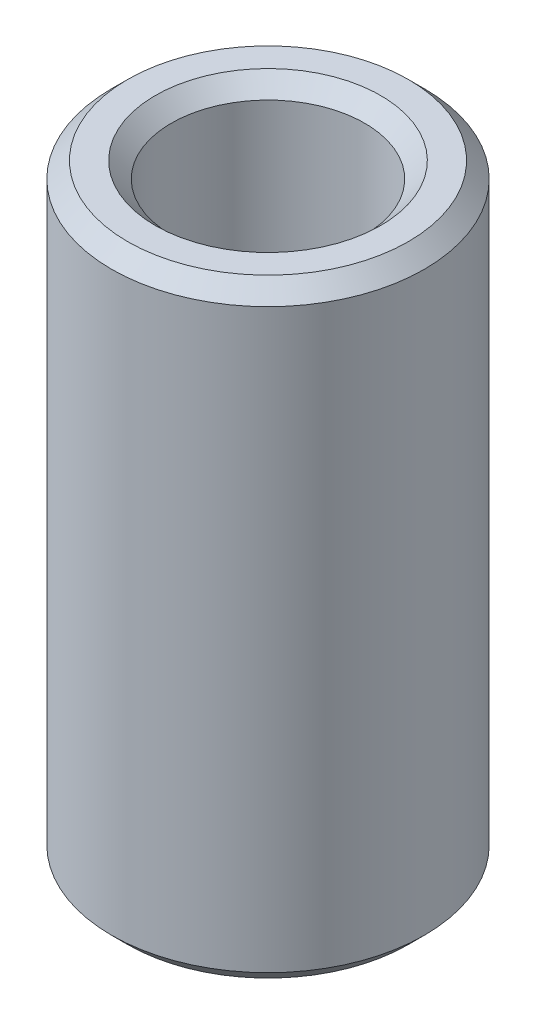
ISO-10303-21;
HEADER;
FILE_DESCRIPTION(('STEP AP214'),'2;1');
FILE_NAME('part.step','',(''),(''),'','','');
FILE_SCHEMA(('AUTOMOTIVE_DESIGN { 1 0 10303 214 1 1 1 1 }'));
ENDSEC;
DATA;
#1=APPLICATION_CONTEXT('core data for automotive mechanical design processes');
#2=APPLICATION_PROTOCOL_DEFINITION('international standard','automotive_design',2000,#1);
#3=PRODUCT_CONTEXT('',#1,'mechanical');
#4=PRODUCT('Part','Part','',(#3));
#5=PRODUCT_RELATED_PRODUCT_CATEGORY('part','',(#4));
#6=PRODUCT_DEFINITION_FORMATION('','',#4);
#7=PRODUCT_DEFINITION_CONTEXT('part definition',#1,'design');
#8=PRODUCT_DEFINITION('design','',#6,#7);
#9=PRODUCT_DEFINITION_SHAPE('','',#8);
#10=(LENGTH_UNIT() NAMED_UNIT(*) SI_UNIT(.MILLI.,.METRE.));
#11=(NAMED_UNIT(*) PLANE_ANGLE_UNIT() SI_UNIT($,.RADIAN.));
#12=(NAMED_UNIT(*) SI_UNIT($,.STERADIAN.) SOLID_ANGLE_UNIT());
#13=UNCERTAINTY_MEASURE_WITH_UNIT(LENGTH_MEASURE(1.E-05),#10,'distance_accuracy_value','');
#14=(GEOMETRIC_REPRESENTATION_CONTEXT(3) GLOBAL_UNCERTAINTY_ASSIGNED_CONTEXT((#13)) GLOBAL_UNIT_ASSIGNED_CONTEXT((#10,
#11,#12)) REPRESENTATION_CONTEXT('',''));
#15=CARTESIAN_POINT('',(0.,0.,0.));
#16=DIRECTION('',(0.,0.,1.));
#17=DIRECTION('',(1.,0.,0.));
#18=AXIS2_PLACEMENT_3D('',#15,#16,#17);
#19=CARTESIAN_POINT('',(0.,145.956649865755,0.));
#20=DIRECTION('',(0.,-1.,0.));
#21=DIRECTION('',(0.,0.,-1.));
#22=AXIS2_PLACEMENT_3D('',#19,#20,#21);
#23=CYLINDRICAL_SURFACE('',#22,37.5);
#24=CARTESIAN_POINT('',(0.,3.83153653893431,0.));
#25=DIRECTION('',(0.,1.,0.));
#26=DIRECTION('',(0.,0.,1.));
#27=AXIS2_PLACEMENT_3D('',#24,#25,#26);
#28=CIRCLE('',#27,37.5);
#29=CARTESIAN_POINT('',(0.,3.83153653893431,37.5));
#30=VERTEX_POINT('',#29);
#31=EDGE_CURVE('E10',#30,#30,#28,.T.);
#32=ORIENTED_EDGE('',*,*,#31,.T.);
#33=EDGE_LOOP('',(#32));
#34=FACE_BOUND('',#33,.T.);
#35=CARTESIAN_POINT('',(0.,142.125113326821,0.));
#36=DIRECTION('',(0.,1.,0.));
#37=DIRECTION('',(0.,0.,1.));
#38=AXIS2_PLACEMENT_3D('',#35,#36,#37);
#39=CIRCLE('',#38,37.5);
#40=CARTESIAN_POINT('',(0.,142.125113326821,37.5));
#41=VERTEX_POINT('',#40);
#42=EDGE_CURVE('E50',#41,#41,#39,.F.);
#43=ORIENTED_EDGE('',*,*,#42,.T.);
#44=EDGE_LOOP('',(#43));
#45=FACE_BOUND('',#44,.T.);
#46=ADVANCED_FACE('F39',(#34,#45),#23,.T.);
#47=CARTESIAN_POINT('',(0.,145.956649865755,0.));
#48=DIRECTION('',(0.,1.,0.));
#49=DIRECTION('',(0.,0.,1.));
#50=AXIS2_PLACEMENT_3D('',#47,#48,#49);
#51=PLANE('',#50);
#52=CARTESIAN_POINT('',(0.,145.956649865755,0.));
#53=DIRECTION('',(0.,1.,0.));
#54=DIRECTION('',(0.,0.,1.));
#55=AXIS2_PLACEMENT_3D('',#52,#53,#54);
#56=CIRCLE('',#55,27.0184228771106);
#57=CARTESIAN_POINT('',(0.,145.956649865755,27.0184228771106));
#58=VERTEX_POINT('',#57);
#59=EDGE_CURVE('E58',#58,#58,#56,.F.);
#60=ORIENTED_EDGE('',*,*,#59,.T.);
#61=EDGE_LOOP('',(#60));
#62=FACE_BOUND('',#61,.T.);
#63=CARTESIAN_POINT('',(0.,145.956649865755,0.));
#64=DIRECTION('',(0.,1.,0.));
#65=DIRECTION('',(0.,0.,1.));
#66=AXIS2_PLACEMENT_3D('',#63,#64,#65);
#67=CIRCLE('',#66,33.6684634610657);
#68=CARTESIAN_POINT('',(0.,145.956649865755,33.6684634610657));
#69=VERTEX_POINT('',#68);
#70=EDGE_CURVE('E61',#69,#69,#67,.T.);
#71=ORIENTED_EDGE('',*,*,#70,.T.);
#72=EDGE_LOOP('',(#71));
#73=FACE_BOUND('',#72,.T.);
#74=ADVANCED_FACE('F88',(#62,#73),#51,.T.);
#75=CARTESIAN_POINT('',(0.,0.,0.));
#76=DIRECTION('',(0.,1.,0.));
#77=DIRECTION('',(0.,0.,1.));
#78=AXIS2_PLACEMENT_3D('',#75,#76,#77);
#79=PLANE('',#78);
#80=CARTESIAN_POINT('',(0.,0.,0.));
#81=DIRECTION('',(0.,1.,0.));
#82=DIRECTION('',(0.,0.,1.));
#83=AXIS2_PLACEMENT_3D('',#80,#81,#82);
#84=CIRCLE('',#83,27.0184228771106);
#85=CARTESIAN_POINT('',(0.,0.,27.0184228771106));
#86=VERTEX_POINT('',#85);
#87=EDGE_CURVE('E51',#86,#86,#84,.T.);
#88=ORIENTED_EDGE('',*,*,#87,.T.);
#89=EDGE_LOOP('',(#88));
#90=FACE_BOUND('',#89,.T.);
#91=CARTESIAN_POINT('',(0.,0.,0.));
#92=DIRECTION('',(0.,1.,0.));
#93=DIRECTION('',(0.,0.,1.));
#94=AXIS2_PLACEMENT_3D('',#91,#92,#93);
#95=CIRCLE('',#94,33.6684634610657);
#96=CARTESIAN_POINT('',(0.,0.,33.6684634610657));
#97=VERTEX_POINT('',#96);
#98=EDGE_CURVE('E54',#97,#97,#95,.F.);
#99=ORIENTED_EDGE('',*,*,#98,.T.);
#100=EDGE_LOOP('',(#99));
#101=FACE_BOUND('',#100,.T.);
#102=ADVANCED_FACE('F83',(#90,#101),#79,.F.);
#103=CARTESIAN_POINT('',(0.,145.956649865755,0.));
#104=DIRECTION('',(0.,-1.,0.));
#105=DIRECTION('',(0.,0.,-1.));
#106=AXIS2_PLACEMENT_3D('',#103,#104,#105);
#107=CYLINDRICAL_SURFACE('',#106,23.1868863381763);
#108=CARTESIAN_POINT('',(0.,142.125113326821,0.));
#109=DIRECTION('',(0.,1.,0.));
#110=DIRECTION('',(0.,0.,1.));
#111=AXIS2_PLACEMENT_3D('',#108,#109,#110);
#112=CIRCLE('',#111,23.1868863381763);
#113=CARTESIAN_POINT('',(0.,142.125113326821,23.1868863381763));
#114=VERTEX_POINT('',#113);
#115=EDGE_CURVE('E67',#114,#114,#112,.T.);
#116=ORIENTED_EDGE('',*,*,#115,.T.);
#117=EDGE_LOOP('',(#116));
#118=FACE_BOUND('',#117,.T.);
#119=CARTESIAN_POINT('',(0.,3.83153653893437,0.));
#120=DIRECTION('',(0.,1.,0.));
#121=DIRECTION('',(0.,0.,1.));
#122=AXIS2_PLACEMENT_3D('',#119,#120,#121);
#123=CIRCLE('',#122,23.1868863381763);
#124=CARTESIAN_POINT('',(0.,3.83153653893437,23.1868863381763));
#125=VERTEX_POINT('',#124);
#126=EDGE_CURVE('E69',#125,#125,#123,.F.);
#127=ORIENTED_EDGE('',*,*,#126,.T.);
#128=EDGE_LOOP('',(#127));
#129=FACE_BOUND('',#128,.T.);
#130=ADVANCED_FACE('F71',(#118,#129),#107,.F.);
#131=CARTESIAN_POINT('',(0.,142.125113326821,0.));
#132=DIRECTION('',(0.,1.,0.));
#133=DIRECTION('',(0.,0.,1.));
#134=AXIS2_PLACEMENT_3D('',#131,#132,#133);
#135=CONICAL_SURFACE('',#134,23.1868863381763,0.785398163397448);
#136=ORIENTED_EDGE('',*,*,#59,.F.);
#137=EDGE_LOOP('',(#136));
#138=FACE_BOUND('',#137,.T.);
#139=ORIENTED_EDGE('',*,*,#115,.F.);
#140=EDGE_LOOP('',(#139));
#141=FACE_BOUND('',#140,.T.);
#142=ADVANCED_FACE('F77',(#138,#141),#135,.F.);
#143=CARTESIAN_POINT('',(0.,0.,0.));
#144=DIRECTION('',(0.,-1.,0.));
#145=DIRECTION('',(0.,0.,-1.));
#146=AXIS2_PLACEMENT_3D('',#143,#144,#145);
#147=CONICAL_SURFACE('',#146,27.0184228771106,0.785398163397444);
#148=ORIENTED_EDGE('',*,*,#126,.F.);
#149=EDGE_LOOP('',(#148));
#150=FACE_BOUND('',#149,.T.);
#151=ORIENTED_EDGE('',*,*,#87,.F.);
#152=EDGE_LOOP('',(#151));
#153=FACE_BOUND('',#152,.T.);
#154=ADVANCED_FACE('F73',(#150,#153),#147,.F.);
#155=CARTESIAN_POINT('',(0.,3.83153653893431,0.));
#156=DIRECTION('',(0.,1.,0.));
#157=DIRECTION('',(0.,0.,1.));
#158=AXIS2_PLACEMENT_3D('',#155,#156,#157);
#159=CONICAL_SURFACE('',#158,37.5,0.78539816339745);
#160=ORIENTED_EDGE('',*,*,#98,.F.);
#161=EDGE_LOOP('',(#160));
#162=FACE_BOUND('',#161,.T.);
#163=ORIENTED_EDGE('',*,*,#31,.F.);
#164=EDGE_LOOP('',(#163));
#165=FACE_BOUND('',#164,.T.);
#166=ADVANCED_FACE('F76',(#162,#165),#159,.T.);
#167=CARTESIAN_POINT('',(0.,145.956649865755,0.));
#168=DIRECTION('',(0.,-1.,0.));
#169=DIRECTION('',(0.,0.,-1.));
#170=AXIS2_PLACEMENT_3D('',#167,#168,#169);
#171=CONICAL_SURFACE('',#170,33.6684634610657,0.785398163397441);
#172=ORIENTED_EDGE('',*,*,#42,.F.);
#173=EDGE_LOOP('',(#172));
#174=FACE_BOUND('',#173,.T.);
#175=ORIENTED_EDGE('',*,*,#70,.F.);
#176=EDGE_LOOP('',(#175));
#177=FACE_BOUND('',#176,.T.);
#178=ADVANCED_FACE('F45',(#174,#177),#171,.T.);
#179=CLOSED_SHELL('',(#46,#74,#102,#130,#142,#154,#166,#178));
#180=MANIFOLD_SOLID_BREP('B2',#179);
#181=ADVANCED_BREP_SHAPE_REPRESENTATION('',(#18,#180),#14);
#182=SHAPE_DEFINITION_REPRESENTATION(#9,#181);
ENDSEC;
END-ISO-10303-21;
